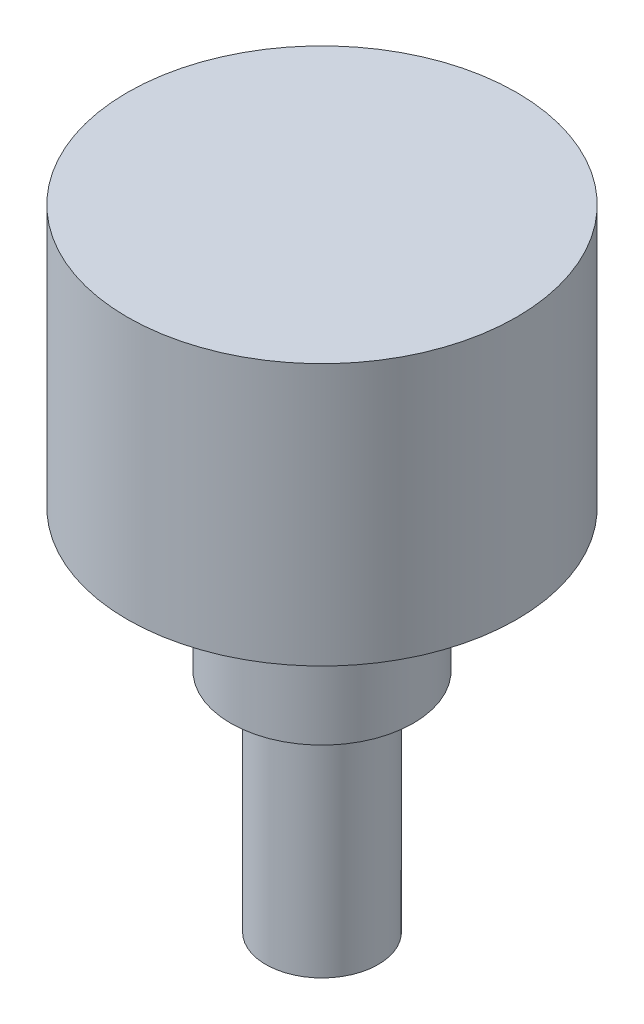
ISO-10303-21;
HEADER;
FILE_DESCRIPTION(('STEP AP214'),'2;1');
FILE_NAME('part.step','',(''),(''),'','','');
FILE_SCHEMA(('AUTOMOTIVE_DESIGN { 1 0 10303 214 1 1 1 1 }'));
ENDSEC;
DATA;
#1=APPLICATION_CONTEXT('core data for automotive mechanical design processes');
#2=APPLICATION_PROTOCOL_DEFINITION('international standard','automotive_design',2000,#1);
#3=PRODUCT_CONTEXT('',#1,'mechanical');
#4=PRODUCT('Part','Part','',(#3));
#5=PRODUCT_RELATED_PRODUCT_CATEGORY('part','',(#4));
#6=PRODUCT_DEFINITION_FORMATION('','',#4);
#7=PRODUCT_DEFINITION_CONTEXT('part definition',#1,'design');
#8=PRODUCT_DEFINITION('design','',#6,#7);
#9=PRODUCT_DEFINITION_SHAPE('','',#8);
#10=(LENGTH_UNIT() NAMED_UNIT(*) SI_UNIT(.MILLI.,.METRE.));
#11=(NAMED_UNIT(*) PLANE_ANGLE_UNIT() SI_UNIT($,.RADIAN.));
#12=(NAMED_UNIT(*) SI_UNIT($,.STERADIAN.) SOLID_ANGLE_UNIT());
#13=UNCERTAINTY_MEASURE_WITH_UNIT(LENGTH_MEASURE(1.E-05),#10,'distance_accuracy_value','');
#14=(GEOMETRIC_REPRESENTATION_CONTEXT(3) GLOBAL_UNCERTAINTY_ASSIGNED_CONTEXT((#13)) GLOBAL_UNIT_ASSIGNED_CONTEXT((#10,
#11,#12)) REPRESENTATION_CONTEXT('',''));
#15=CARTESIAN_POINT('',(0.,0.,0.));
#16=DIRECTION('',(0.,0.,1.));
#17=DIRECTION('',(1.,0.,0.));
#18=AXIS2_PLACEMENT_3D('',#15,#16,#17);
#19=CARTESIAN_POINT('',(0.,14.8,0.));
#20=DIRECTION('',(0.,-1.,0.));
#21=DIRECTION('',(0.,0.,-1.));
#22=AXIS2_PLACEMENT_3D('',#19,#20,#21);
#23=CYLINDRICAL_SURFACE('',#22,11.);
#24=CARTESIAN_POINT('',(0.,14.8,0.));
#25=DIRECTION('',(0.,1.,0.));
#26=DIRECTION('',(0.,0.,1.));
#27=AXIS2_PLACEMENT_3D('',#24,#25,#26);
#28=CIRCLE('',#27,11.);
#29=CARTESIAN_POINT('',(0.,14.8,11.));
#30=VERTEX_POINT('',#29);
#31=EDGE_CURVE('E53',#30,#30,#28,.T.);
#32=ORIENTED_EDGE('',*,*,#31,.F.);
#33=EDGE_LOOP('',(#32));
#34=FACE_BOUND('',#33,.T.);
#35=CARTESIAN_POINT('',(0.,0.,0.));
#36=DIRECTION('',(0.,1.,0.));
#37=DIRECTION('',(0.,0.,1.));
#38=AXIS2_PLACEMENT_3D('',#35,#36,#37);
#39=CIRCLE('',#38,11.);
#40=CARTESIAN_POINT('',(0.,0.,11.));
#41=VERTEX_POINT('',#40);
#42=EDGE_CURVE('E61',#41,#41,#39,.T.);
#43=ORIENTED_EDGE('',*,*,#42,.T.);
#44=EDGE_LOOP('',(#43));
#45=FACE_BOUND('',#44,.T.);
#46=ADVANCED_FACE('F37',(#34,#45),#23,.T.);
#47=CARTESIAN_POINT('',(0.,14.8,0.));
#48=DIRECTION('',(0.,1.,0.));
#49=DIRECTION('',(0.,0.,1.));
#50=AXIS2_PLACEMENT_3D('',#47,#48,#49);
#51=PLANE('',#50);
#52=ORIENTED_EDGE('',*,*,#31,.T.);
#53=EDGE_LOOP('',(#52));
#54=FACE_BOUND('',#53,.T.);
#55=ADVANCED_FACE('F73',(#54),#51,.T.);
#56=CARTESIAN_POINT('',(0.,0.,0.));
#57=DIRECTION('',(0.,1.,0.));
#58=DIRECTION('',(0.,0.,1.));
#59=AXIS2_PLACEMENT_3D('',#56,#57,#58);
#60=PLANE('',#59);
#61=CARTESIAN_POINT('',(7.9,0.,0.));
#62=DIRECTION('',(0.,1.,0.));
#63=DIRECTION('',(0.,0.,1.));
#64=AXIS2_PLACEMENT_3D('',#61,#62,#63);
#65=CIRCLE('',#64,0.75);
#66=CARTESIAN_POINT('',(7.9,0.,0.75));
#67=VERTEX_POINT('',#66);
#68=EDGE_CURVE('E10',#67,#67,#65,.F.);
#69=ORIENTED_EDGE('',*,*,#68,.F.);
#70=EDGE_LOOP('',(#69));
#71=FACE_BOUND('',#70,.T.);
#72=CARTESIAN_POINT('',(0.,0.,0.));
#73=DIRECTION('',(0.,-1.,0.));
#74=DIRECTION('',(0.,0.,-1.));
#75=AXIS2_PLACEMENT_3D('',#72,#73,#74);
#76=CIRCLE('',#75,5.16);
#77=CARTESIAN_POINT('',(0.,0.,-5.16));
#78=VERTEX_POINT('',#77);
#79=EDGE_CURVE('E47',#78,#78,#76,.T.);
#80=ORIENTED_EDGE('',*,*,#79,.F.);
#81=EDGE_LOOP('',(#80));
#82=FACE_BOUND('',#81,.T.);
#83=ORIENTED_EDGE('',*,*,#42,.F.);
#84=EDGE_LOOP('',(#83));
#85=FACE_BOUND('',#84,.T.);
#86=ADVANCED_FACE('F70',(#71,#82,#85),#60,.F.);
#87=CARTESIAN_POINT('',(0.,-8.,0.));
#88=DIRECTION('',(0.,1.,0.));
#89=DIRECTION('',(0.,0.,1.));
#90=AXIS2_PLACEMENT_3D('',#87,#88,#89);
#91=CYLINDRICAL_SURFACE('',#90,5.16);
#92=CARTESIAN_POINT('',(0.,-8.,0.));
#93=DIRECTION('',(0.,-1.,0.));
#94=DIRECTION('',(0.,0.,-1.));
#95=AXIS2_PLACEMENT_3D('',#92,#93,#94);
#96=CIRCLE('',#95,5.16);
#97=CARTESIAN_POINT('',(0.,-8.,-5.16));
#98=VERTEX_POINT('',#97);
#99=EDGE_CURVE('E59',#98,#98,#96,.T.);
#100=ORIENTED_EDGE('',*,*,#99,.F.);
#101=EDGE_LOOP('',(#100));
#102=FACE_BOUND('',#101,.T.);
#103=ORIENTED_EDGE('',*,*,#79,.T.);
#104=EDGE_LOOP('',(#103));
#105=FACE_BOUND('',#104,.T.);
#106=ADVANCED_FACE('F72',(#102,#105),#91,.T.);
#107=CARTESIAN_POINT('',(0.,-8.,0.));
#108=DIRECTION('',(0.,-1.,0.));
#109=DIRECTION('',(0.,0.,-1.));
#110=AXIS2_PLACEMENT_3D('',#107,#108,#109);
#111=PLANE('',#110);
#112=CARTESIAN_POINT('',(0.,-8.,0.));
#113=DIRECTION('',(0.,-1.,0.));
#114=DIRECTION('',(0.,0.,-1.));
#115=AXIS2_PLACEMENT_3D('',#112,#113,#114);
#116=CIRCLE('',#115,3.175);
#117=CARTESIAN_POINT('',(0.,-8.,-3.175));
#118=VERTEX_POINT('',#117);
#119=EDGE_CURVE('E43',#118,#118,#116,.T.);
#120=ORIENTED_EDGE('',*,*,#119,.F.);
#121=EDGE_LOOP('',(#120));
#122=FACE_BOUND('',#121,.T.);
#123=ORIENTED_EDGE('',*,*,#99,.T.);
#124=EDGE_LOOP('',(#123));
#125=FACE_BOUND('',#124,.T.);
#126=ADVANCED_FACE('F79',(#122,#125),#111,.T.);
#127=CARTESIAN_POINT('',(0.,-20.8,0.));
#128=DIRECTION('',(0.,1.,0.));
#129=DIRECTION('',(0.,0.,1.));
#130=AXIS2_PLACEMENT_3D('',#127,#128,#129);
#131=CYLINDRICAL_SURFACE('',#130,3.175);
#132=CARTESIAN_POINT('',(0.,-20.8,0.));
#133=DIRECTION('',(0.,-1.,0.));
#134=DIRECTION('',(0.,0.,-1.));
#135=AXIS2_PLACEMENT_3D('',#132,#133,#134);
#136=CIRCLE('',#135,3.175);
#137=CARTESIAN_POINT('',(0.,-20.8,-3.175));
#138=VERTEX_POINT('',#137);
#139=EDGE_CURVE('E57',#138,#138,#136,.T.);
#140=ORIENTED_EDGE('',*,*,#139,.F.);
#141=EDGE_LOOP('',(#140));
#142=FACE_BOUND('',#141,.T.);
#143=ORIENTED_EDGE('',*,*,#119,.T.);
#144=EDGE_LOOP('',(#143));
#145=FACE_BOUND('',#144,.T.);
#146=ADVANCED_FACE('F108',(#142,#145),#131,.T.);
#147=CARTESIAN_POINT('',(0.,-20.8,0.));
#148=DIRECTION('',(0.,-1.,0.));
#149=DIRECTION('',(0.,0.,-1.));
#150=AXIS2_PLACEMENT_3D('',#147,#148,#149);
#151=PLANE('',#150);
#152=ORIENTED_EDGE('',*,*,#139,.T.);
#153=EDGE_LOOP('',(#152));
#154=FACE_BOUND('',#153,.T.);
#155=ADVANCED_FACE('F123',(#154),#151,.T.);
#156=CARTESIAN_POINT('',(7.9,-2.1,0.));
#157=DIRECTION('',(0.,1.,0.));
#158=DIRECTION('',(0.,0.,1.));
#159=AXIS2_PLACEMENT_3D('',#156,#157,#158);
#160=CYLINDRICAL_SURFACE('',#159,0.75);
#161=CARTESIAN_POINT('',(7.9,-2.1,0.));
#162=DIRECTION('',(0.,-1.,0.));
#163=DIRECTION('',(0.,0.,-1.));
#164=AXIS2_PLACEMENT_3D('',#161,#162,#163);
#165=CIRCLE('',#164,0.75);
#166=CARTESIAN_POINT('',(7.9,-2.1,-0.75));
#167=VERTEX_POINT('',#166);
#168=EDGE_CURVE('E166',#167,#167,#165,.T.);
#169=ORIENTED_EDGE('',*,*,#168,.F.);
#170=EDGE_LOOP('',(#169));
#171=FACE_BOUND('',#170,.T.);
#172=ORIENTED_EDGE('',*,*,#68,.T.);
#173=EDGE_LOOP('',(#172));
#174=FACE_BOUND('',#173,.T.);
#175=ADVANCED_FACE('F133',(#171,#174),#160,.T.);
#176=CARTESIAN_POINT('',(7.9,-2.1,0.));
#177=DIRECTION('',(0.,-1.,0.));
#178=DIRECTION('',(0.,0.,-1.));
#179=AXIS2_PLACEMENT_3D('',#176,#177,#178);
#180=PLANE('',#179);
#181=ORIENTED_EDGE('',*,*,#168,.T.);
#182=EDGE_LOOP('',(#181));
#183=FACE_BOUND('',#182,.T.);
#184=ADVANCED_FACE('F150',(#183),#180,.T.);
#185=CLOSED_SHELL('',(#46,#55,#86,#106,#126,#146,#155,#175,#184));
#186=MANIFOLD_SOLID_BREP('B2',#185);
#187=ADVANCED_BREP_SHAPE_REPRESENTATION('',(#18,#186),#14);
#188=SHAPE_DEFINITION_REPRESENTATION(#9,#187);
ENDSEC;
END-ISO-10303-21;
